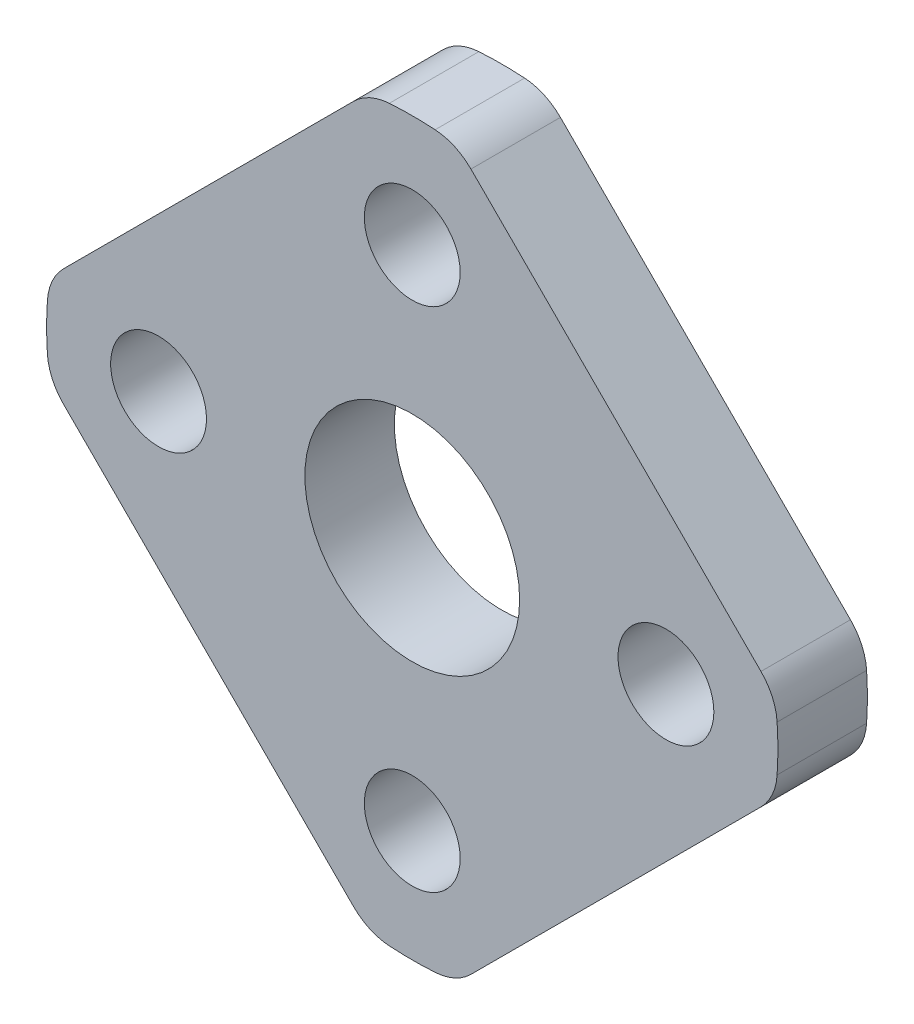
ISO-10303-21;
HEADER;
FILE_DESCRIPTION(('STEP AP214'),'2;1');
FILE_NAME('part.step','',(''),(''),'','','');
FILE_SCHEMA(('AUTOMOTIVE_DESIGN { 1 0 10303 214 1 1 1 1 }'));
ENDSEC;
DATA;
#1=APPLICATION_CONTEXT('core data for automotive mechanical design processes');
#2=APPLICATION_PROTOCOL_DEFINITION('international standard','automotive_design',2000,#1);
#3=PRODUCT_CONTEXT('',#1,'mechanical');
#4=PRODUCT('Part','Part','',(#3));
#5=PRODUCT_RELATED_PRODUCT_CATEGORY('part','',(#4));
#6=PRODUCT_DEFINITION_FORMATION('','',#4);
#7=PRODUCT_DEFINITION_CONTEXT('part definition',#1,'design');
#8=PRODUCT_DEFINITION('design','',#6,#7);
#9=PRODUCT_DEFINITION_SHAPE('','',#8);
#10=(LENGTH_UNIT() NAMED_UNIT(*) SI_UNIT(.MILLI.,.METRE.));
#11=(NAMED_UNIT(*) PLANE_ANGLE_UNIT() SI_UNIT($,.RADIAN.));
#12=(NAMED_UNIT(*) SI_UNIT($,.STERADIAN.) SOLID_ANGLE_UNIT());
#13=UNCERTAINTY_MEASURE_WITH_UNIT(LENGTH_MEASURE(1.E-05),#10,'distance_accuracy_value','');
#14=(GEOMETRIC_REPRESENTATION_CONTEXT(3) GLOBAL_UNCERTAINTY_ASSIGNED_CONTEXT((#13)) GLOBAL_UNIT_ASSIGNED_CONTEXT((#10,
#11,#12)) REPRESENTATION_CONTEXT('',''));
#15=CARTESIAN_POINT('',(0.,0.,0.));
#16=DIRECTION('',(0.,0.,1.));
#17=DIRECTION('',(1.,0.,0.));
#18=AXIS2_PLACEMENT_3D('',#15,#16,#17);
#19=CARTESIAN_POINT('',(-0.688852037974348,10.9784098516032,3.175));
#20=DIRECTION('',(0.,0.,1.));
#21=DIRECTION('',(1.,0.,0.));
#22=AXIS2_PLACEMENT_3D('',#19,#20,#21);
#23=PLANE('',#22);
#24=CARTESIAN_POINT('',(9.00000000000001,0.,3.175));
#25=DIRECTION('',(0.,0.,1.));
#26=DIRECTION('',(1.,0.,0.));
#27=AXIS2_PLACEMENT_3D('',#24,#25,#26);
#28=CIRCLE('',#27,1.7);
#29=CARTESIAN_POINT('',(10.7,0.,3.175));
#30=VERTEX_POINT('',#29);
#31=EDGE_CURVE('E357',#30,#30,#28,.T.);
#32=ORIENTED_EDGE('',*,*,#31,.F.);
#33=EDGE_LOOP('',(#32));
#34=FACE_BOUND('',#33,.T.);
#35=CARTESIAN_POINT('',(-8.99999999999999,0.,3.175));
#36=DIRECTION('',(0.,0.,1.));
#37=DIRECTION('',(1.,0.,0.));
#38=AXIS2_PLACEMENT_3D('',#35,#36,#37);
#39=CIRCLE('',#38,1.7);
#40=CARTESIAN_POINT('',(-7.29999999999999,0.,3.175));
#41=VERTEX_POINT('',#40);
#42=EDGE_CURVE('E369',#41,#41,#39,.T.);
#43=ORIENTED_EDGE('',*,*,#42,.F.);
#44=EDGE_LOOP('',(#43));
#45=FACE_BOUND('',#44,.T.);
#46=CARTESIAN_POINT('',(-0.688852037974348,10.9784098516032,3.175));
#47=DIRECTION('',(0.,0.,1.));
#48=DIRECTION('',(1.,0.,0.));
#49=AXIS2_PLACEMENT_3D('',#46,#47,#48);
#50=CIRCLE('',#49,1.97);
#51=CARTESIAN_POINT('',(-0.812219175684301,12.9445432522994,3.175));
#52=VERTEX_POINT('',#51);
#53=CARTESIAN_POINT('',(-2.08185239691184,12.3714102105407,3.175));
#54=VERTEX_POINT('',#53);
#55=EDGE_CURVE('E219',#52,#54,#50,.T.);
#56=ORIENTED_EDGE('',*,*,#55,.T.);
#57=DIRECTION('',(-0.707106781186547,-0.707106781186547,0.));
#58=VECTOR('',#57,1.);
#59=CARTESIAN_POINT('',(-2.08185239691184,12.3714102105407,3.175));
#60=LINE('',#59,#58);
#61=CARTESIAN_POINT('',(-12.3714102105407,2.08185239691188,3.175));
#62=VERTEX_POINT('',#61);
#63=EDGE_CURVE('E127',#54,#62,#60,.T.);
#64=ORIENTED_EDGE('',*,*,#63,.T.);
#65=CARTESIAN_POINT('',(-10.978409851603,0.688852037974608,3.175));
#66=DIRECTION('',(0.,0.,1.));
#67=DIRECTION('',(1.,0.,0.));
#68=AXIS2_PLACEMENT_3D('',#65,#66,#67);
#69=CIRCLE('',#68,1.96999999999997);
#70=CARTESIAN_POINT('',(-12.9445432522992,0.812219175684563,3.175));
#71=VERTEX_POINT('',#70);
#72=EDGE_CURVE('E258',#62,#71,#69,.T.);
#73=ORIENTED_EDGE('',*,*,#72,.T.);
#74=CARTESIAN_POINT('',(2.09793120375945E-13,1.96030529048957E-13,3.175));
#75=DIRECTION('',(0.,0.,1.));
#76=DIRECTION('',(1.,0.,0.));
#77=AXIS2_PLACEMENT_3D('',#74,#75,#76);
#78=CIRCLE('',#77,12.97);
#79=CARTESIAN_POINT('',(-12.9445432522992,-0.812219175684114,3.175));
#80=VERTEX_POINT('',#79);
#81=EDGE_CURVE('E277',#71,#80,#78,.T.);
#82=ORIENTED_EDGE('',*,*,#81,.T.);
#83=CARTESIAN_POINT('',(-10.978409851603,-0.688852037974166,3.175));
#84=DIRECTION('',(0.,0.,1.));
#85=DIRECTION('',(1.,0.,0.));
#86=AXIS2_PLACEMENT_3D('',#83,#84,#85);
#87=CIRCLE('',#86,1.97);
#88=CARTESIAN_POINT('',(-12.3714102105405,-2.08185239691166,3.175));
#89=VERTEX_POINT('',#88);
#90=EDGE_CURVE('E274',#80,#89,#87,.T.);
#91=ORIENTED_EDGE('',*,*,#90,.T.);
#92=DIRECTION('',(0.707106781186548,-0.707106781186548,0.));
#93=VECTOR('',#92,1.);
#94=CARTESIAN_POINT('',(-12.3714102105405,-2.08185239691167,3.175));
#95=LINE('',#94,#93);
#96=CARTESIAN_POINT('',(-2.08185239691154,-12.3714102105406,3.175));
#97=VERTEX_POINT('',#96);
#98=EDGE_CURVE('E276',#89,#97,#95,.T.);
#99=ORIENTED_EDGE('',*,*,#98,.T.);
#100=CARTESIAN_POINT('',(-0.688852037974057,-10.9784098516031,3.175));
#101=DIRECTION('',(0.,0.,1.));
#102=DIRECTION('',(1.,0.,0.));
#103=AXIS2_PLACEMENT_3D('',#100,#101,#102);
#104=CIRCLE('',#103,1.96999999999999);
#105=CARTESIAN_POINT('',(-0.812219175684017,-12.9445432522993,3.175));
#106=VERTEX_POINT('',#105);
#107=EDGE_CURVE('E279',#97,#106,#104,.T.);
#108=ORIENTED_EDGE('',*,*,#107,.T.);
#109=CARTESIAN_POINT('',(3.52799386926783E-13,1.03080521549059E-13,3.175));
#110=DIRECTION('',(0.,0.,1.));
#111=DIRECTION('',(1.,0.,0.));
#112=AXIS2_PLACEMENT_3D('',#109,#110,#111);
#113=CIRCLE('',#112,12.97);
#114=CARTESIAN_POINT('',(0.812219175684657,-12.9445432522993,3.175));
#115=VERTEX_POINT('',#114);
#116=EDGE_CURVE('E285',#106,#115,#113,.T.);
#117=ORIENTED_EDGE('',*,*,#116,.T.);
#118=CARTESIAN_POINT('',(0.688852037974714,-10.9784098516031,3.175));
#119=DIRECTION('',(0.,0.,1.));
#120=DIRECTION('',(1.,0.,0.));
#121=AXIS2_PLACEMENT_3D('',#118,#119,#120);
#122=CIRCLE('',#121,1.97000000000001);
#123=CARTESIAN_POINT('',(2.08185239691289,-12.3714102105399,3.175));
#124=VERTEX_POINT('',#123);
#125=EDGE_CURVE('E287',#115,#124,#122,.T.);
#126=ORIENTED_EDGE('',*,*,#125,.T.);
#127=DIRECTION('',(0.707106781186548,0.707106781186547,0.));
#128=VECTOR('',#127,1.);
#129=CARTESIAN_POINT('',(2.08185239691289,-12.3714102105399,3.175));
#130=LINE('',#129,#128);
#131=CARTESIAN_POINT('',(12.3714102105413,-2.08185239691153,3.175));
#132=VERTEX_POINT('',#131);
#133=EDGE_CURVE('E289',#124,#132,#130,.T.);
#134=ORIENTED_EDGE('',*,*,#133,.T.);
#135=CARTESIAN_POINT('',(10.9784098516038,-0.688852037974074,3.175));
#136=DIRECTION('',(0.,0.,1.));
#137=DIRECTION('',(1.,0.,0.));
#138=AXIS2_PLACEMENT_3D('',#135,#136,#137);
#139=CIRCLE('',#138,1.96999999999996);
#140=CARTESIAN_POINT('',(12.9445432523,-0.81221917568395,3.175));
#141=VERTEX_POINT('',#140);
#142=EDGE_CURVE('E291',#132,#141,#139,.T.);
#143=ORIENTED_EDGE('',*,*,#142,.T.);
#144=CARTESIAN_POINT('',(5.90902417543838E-13,3.71528485224192E-13,3.175));
#145=DIRECTION('',(0.,0.,1.));
#146=DIRECTION('',(1.,0.,0.));
#147=AXIS2_PLACEMENT_3D('',#144,#145,#146);
#148=CIRCLE('',#147,12.97);
#149=CARTESIAN_POINT('',(12.9445432523,0.8122191756847,3.175));
#150=VERTEX_POINT('',#149);
#151=EDGE_CURVE('E293',#141,#150,#148,.T.);
#152=ORIENTED_EDGE('',*,*,#151,.T.);
#153=CARTESIAN_POINT('',(10.9784098516038,0.688852037973795,3.175));
#154=DIRECTION('',(0.,0.,1.));
#155=DIRECTION('',(1.,0.,0.));
#156=AXIS2_PLACEMENT_3D('',#153,#154,#155);
#157=CIRCLE('',#156,1.97);
#158=CARTESIAN_POINT('',(12.3714102105397,2.08185239691295,3.175));
#159=VERTEX_POINT('',#158);
#160=EDGE_CURVE('E170',#150,#159,#157,.T.);
#161=ORIENTED_EDGE('',*,*,#160,.T.);
#162=DIRECTION('',(-0.707106781186548,0.707106781186548,0.));
#163=VECTOR('',#162,1.);
#164=CARTESIAN_POINT('',(12.3714102105397,2.08185239691295,3.175));
#165=LINE('',#164,#163);
#166=CARTESIAN_POINT('',(2.08185239691191,12.3714102105407,3.175));
#167=VERTEX_POINT('',#166);
#168=EDGE_CURVE('E164',#159,#167,#165,.T.);
#169=ORIENTED_EDGE('',*,*,#168,.T.);
#170=CARTESIAN_POINT('',(0.688852037974424,10.9784098516032,3.175));
#171=DIRECTION('',(0.,0.,1.));
#172=DIRECTION('',(1.,0.,0.));
#173=AXIS2_PLACEMENT_3D('',#170,#171,#172);
#174=CIRCLE('',#173,1.96999999999999);
#175=CARTESIAN_POINT('',(0.812219175684387,12.9445432522994,3.175));
#176=VERTEX_POINT('',#175);
#177=EDGE_CURVE('E168',#167,#176,#174,.T.);
#178=ORIENTED_EDGE('',*,*,#177,.T.);
#179=CARTESIAN_POINT('',(0.,0.,3.175));
#180=DIRECTION('',(0.,0.,1.));
#181=DIRECTION('',(1.,0.,0.));
#182=AXIS2_PLACEMENT_3D('',#179,#180,#181);
#183=CIRCLE('',#182,12.97);
#184=EDGE_CURVE('E60',#176,#52,#183,.T.);
#185=ORIENTED_EDGE('',*,*,#184,.T.);
#186=EDGE_LOOP('',(#56,#64,#73,#82,#91,#99,#108,#117,#126,#134,#143,#152,#161,#169,#178,#185));
#187=FACE_BOUND('',#186,.T.);
#188=CARTESIAN_POINT('',(0.,-9.,3.175));
#189=DIRECTION('',(0.,0.,1.));
#190=DIRECTION('',(1.,0.,0.));
#191=AXIS2_PLACEMENT_3D('',#188,#189,#190);
#192=CIRCLE('',#191,1.7);
#193=CARTESIAN_POINT('',(1.70000000000002,-9.,3.175));
#194=VERTEX_POINT('',#193);
#195=EDGE_CURVE('E192',#194,#194,#192,.T.);
#196=ORIENTED_EDGE('',*,*,#195,.F.);
#197=EDGE_LOOP('',(#196));
#198=FACE_BOUND('',#197,.T.);
#199=CARTESIAN_POINT('',(0.,9.,3.175));
#200=DIRECTION('',(0.,0.,1.));
#201=DIRECTION('',(1.,0.,0.));
#202=AXIS2_PLACEMENT_3D('',#199,#200,#201);
#203=CIRCLE('',#202,1.7);
#204=CARTESIAN_POINT('',(1.70000000000001,9.,3.175));
#205=VERTEX_POINT('',#204);
#206=EDGE_CURVE('E363',#205,#205,#203,.T.);
#207=ORIENTED_EDGE('',*,*,#206,.F.);
#208=EDGE_LOOP('',(#207));
#209=FACE_BOUND('',#208,.T.);
#210=CARTESIAN_POINT('',(2.09793120375945E-13,1.96030529048957E-13,3.175));
#211=DIRECTION('',(0.,0.,1.));
#212=DIRECTION('',(1.,0.,0.));
#213=AXIS2_PLACEMENT_3D('',#210,#211,#212);
#214=CIRCLE('',#213,3.81);
#215=CARTESIAN_POINT('',(3.81000000000021,1.96030529048957E-13,3.175));
#216=VERTEX_POINT('',#215);
#217=EDGE_CURVE('E348',#216,#216,#214,.T.);
#218=ORIENTED_EDGE('',*,*,#217,.F.);
#219=EDGE_LOOP('',(#218));
#220=FACE_BOUND('',#219,.T.);
#221=ADVANCED_FACE('F43',(#34,#45,#187,#198,#209,#220),#23,.T.);
#222=CARTESIAN_POINT('',(-0.688852037974348,10.9784098516032,0.));
#223=DIRECTION('',(0.,0.,1.));
#224=DIRECTION('',(1.,0.,0.));
#225=AXIS2_PLACEMENT_3D('',#222,#223,#224);
#226=PLANE('',#225);
#227=CARTESIAN_POINT('',(-0.688852037974348,10.9784098516032,0.));
#228=DIRECTION('',(0.,0.,1.));
#229=DIRECTION('',(1.,0.,0.));
#230=AXIS2_PLACEMENT_3D('',#227,#228,#229);
#231=CIRCLE('',#230,1.97);
#232=CARTESIAN_POINT('',(-0.812219175684301,12.9445432522994,0.));
#233=VERTEX_POINT('',#232);
#234=CARTESIAN_POINT('',(-2.08185239691184,12.3714102105407,0.));
#235=VERTEX_POINT('',#234);
#236=EDGE_CURVE('E188',#233,#235,#231,.T.);
#237=ORIENTED_EDGE('',*,*,#236,.F.);
#238=CARTESIAN_POINT('',(0.,0.,0.));
#239=DIRECTION('',(0.,0.,1.));
#240=DIRECTION('',(1.,0.,0.));
#241=AXIS2_PLACEMENT_3D('',#238,#239,#240);
#242=CIRCLE('',#241,12.97);
#243=CARTESIAN_POINT('',(0.812219175684387,12.9445432522994,0.));
#244=VERTEX_POINT('',#243);
#245=EDGE_CURVE('E119',#244,#233,#242,.T.);
#246=ORIENTED_EDGE('',*,*,#245,.F.);
#247=CARTESIAN_POINT('',(0.688852037974424,10.9784098516032,0.));
#248=DIRECTION('',(0.,0.,1.));
#249=DIRECTION('',(1.,0.,0.));
#250=AXIS2_PLACEMENT_3D('',#247,#248,#249);
#251=CIRCLE('',#250,1.96999999999999);
#252=CARTESIAN_POINT('',(2.08185239691191,12.3714102105407,0.));
#253=VERTEX_POINT('',#252);
#254=EDGE_CURVE('E113',#253,#244,#251,.T.);
#255=ORIENTED_EDGE('',*,*,#254,.F.);
#256=DIRECTION('',(-0.707106781186548,0.707106781186548,0.));
#257=VECTOR('',#256,1.);
#258=CARTESIAN_POINT('',(12.3714102105397,2.08185239691295,0.));
#259=LINE('',#258,#257);
#260=CARTESIAN_POINT('',(12.3714102105397,2.08185239691295,0.));
#261=VERTEX_POINT('',#260);
#262=EDGE_CURVE('E178',#261,#253,#259,.T.);
#263=ORIENTED_EDGE('',*,*,#262,.F.);
#264=CARTESIAN_POINT('',(10.9784098516038,0.688852037973795,0.));
#265=DIRECTION('',(0.,0.,1.));
#266=DIRECTION('',(1.,0.,0.));
#267=AXIS2_PLACEMENT_3D('',#264,#265,#266);
#268=CIRCLE('',#267,1.97);
#269=CARTESIAN_POINT('',(12.9445432523,0.8122191756847,0.));
#270=VERTEX_POINT('',#269);
#271=EDGE_CURVE('E214',#270,#261,#268,.T.);
#272=ORIENTED_EDGE('',*,*,#271,.F.);
#273=CARTESIAN_POINT('',(5.90902417543838E-13,3.71528485224192E-13,0.));
#274=DIRECTION('',(0.,0.,1.));
#275=DIRECTION('',(1.,0.,0.));
#276=AXIS2_PLACEMENT_3D('',#273,#274,#275);
#277=CIRCLE('',#276,12.97);
#278=CARTESIAN_POINT('',(12.9445432523,-0.81221917568395,0.));
#279=VERTEX_POINT('',#278);
#280=EDGE_CURVE('E212',#279,#270,#277,.T.);
#281=ORIENTED_EDGE('',*,*,#280,.F.);
#282=CARTESIAN_POINT('',(10.9784098516038,-0.688852037974074,0.));
#283=DIRECTION('',(0.,0.,1.));
#284=DIRECTION('',(1.,0.,0.));
#285=AXIS2_PLACEMENT_3D('',#282,#283,#284);
#286=CIRCLE('',#285,1.96999999999996);
#287=CARTESIAN_POINT('',(12.3714102105413,-2.08185239691153,0.));
#288=VERTEX_POINT('',#287);
#289=EDGE_CURVE('E210',#288,#279,#286,.T.);
#290=ORIENTED_EDGE('',*,*,#289,.F.);
#291=DIRECTION('',(0.707106781186548,0.707106781186547,0.));
#292=VECTOR('',#291,1.);
#293=CARTESIAN_POINT('',(2.08185239691289,-12.3714102105399,0.));
#294=LINE('',#293,#292);
#295=CARTESIAN_POINT('',(2.08185239691289,-12.3714102105399,0.));
#296=VERTEX_POINT('',#295);
#297=EDGE_CURVE('E208',#296,#288,#294,.T.);
#298=ORIENTED_EDGE('',*,*,#297,.F.);
#299=CARTESIAN_POINT('',(0.688852037974714,-10.9784098516031,0.));
#300=DIRECTION('',(0.,0.,1.));
#301=DIRECTION('',(1.,0.,0.));
#302=AXIS2_PLACEMENT_3D('',#299,#300,#301);
#303=CIRCLE('',#302,1.97000000000001);
#304=CARTESIAN_POINT('',(0.812219175684657,-12.9445432522993,0.));
#305=VERTEX_POINT('',#304);
#306=EDGE_CURVE('E206',#305,#296,#303,.T.);
#307=ORIENTED_EDGE('',*,*,#306,.F.);
#308=CARTESIAN_POINT('',(3.52799386926783E-13,1.03080521549059E-13,0.));
#309=DIRECTION('',(0.,0.,1.));
#310=DIRECTION('',(1.,0.,0.));
#311=AXIS2_PLACEMENT_3D('',#308,#309,#310);
#312=CIRCLE('',#311,12.97);
#313=CARTESIAN_POINT('',(-0.812219175684017,-12.9445432522993,0.));
#314=VERTEX_POINT('',#313);
#315=EDGE_CURVE('E204',#314,#305,#312,.T.);
#316=ORIENTED_EDGE('',*,*,#315,.F.);
#317=CARTESIAN_POINT('',(-0.688852037974057,-10.9784098516031,0.));
#318=DIRECTION('',(0.,0.,1.));
#319=DIRECTION('',(1.,0.,0.));
#320=AXIS2_PLACEMENT_3D('',#317,#318,#319);
#321=CIRCLE('',#320,1.96999999999999);
#322=CARTESIAN_POINT('',(-2.08185239691154,-12.3714102105406,0.));
#323=VERTEX_POINT('',#322);
#324=EDGE_CURVE('E202',#323,#314,#321,.T.);
#325=ORIENTED_EDGE('',*,*,#324,.F.);
#326=DIRECTION('',(0.707106781186548,-0.707106781186548,0.));
#327=VECTOR('',#326,1.);
#328=CARTESIAN_POINT('',(-12.3714102105405,-2.08185239691167,0.));
#329=LINE('',#328,#327);
#330=CARTESIAN_POINT('',(-12.3714102105405,-2.08185239691166,0.));
#331=VERTEX_POINT('',#330);
#332=EDGE_CURVE('E200',#331,#323,#329,.T.);
#333=ORIENTED_EDGE('',*,*,#332,.F.);
#334=CARTESIAN_POINT('',(-10.978409851603,-0.688852037974166,0.));
#335=DIRECTION('',(0.,0.,1.));
#336=DIRECTION('',(1.,0.,0.));
#337=AXIS2_PLACEMENT_3D('',#334,#335,#336);
#338=CIRCLE('',#337,1.97);
#339=CARTESIAN_POINT('',(-12.9445432522992,-0.812219175684114,0.));
#340=VERTEX_POINT('',#339);
#341=EDGE_CURVE('E198',#340,#331,#338,.T.);
#342=ORIENTED_EDGE('',*,*,#341,.F.);
#343=CARTESIAN_POINT('',(2.09793120375945E-13,1.96030529048957E-13,0.));
#344=DIRECTION('',(0.,0.,1.));
#345=DIRECTION('',(1.,0.,0.));
#346=AXIS2_PLACEMENT_3D('',#343,#344,#345);
#347=CIRCLE('',#346,12.97);
#348=CARTESIAN_POINT('',(-12.9445432522992,0.812219175684563,0.));
#349=VERTEX_POINT('',#348);
#350=EDGE_CURVE('E196',#349,#340,#347,.T.);
#351=ORIENTED_EDGE('',*,*,#350,.F.);
#352=CARTESIAN_POINT('',(-10.978409851603,0.688852037974608,0.));
#353=DIRECTION('',(0.,0.,1.));
#354=DIRECTION('',(1.,0.,0.));
#355=AXIS2_PLACEMENT_3D('',#352,#353,#354);
#356=CIRCLE('',#355,1.96999999999997);
#357=CARTESIAN_POINT('',(-12.3714102105407,2.08185239691188,0.));
#358=VERTEX_POINT('',#357);
#359=EDGE_CURVE('E194',#358,#349,#356,.T.);
#360=ORIENTED_EDGE('',*,*,#359,.F.);
#361=DIRECTION('',(-0.707106781186547,-0.707106781186547,0.));
#362=VECTOR('',#361,1.);
#363=CARTESIAN_POINT('',(-2.08185239691184,12.3714102105407,0.));
#364=LINE('',#363,#362);
#365=EDGE_CURVE('E191',#235,#358,#364,.T.);
#366=ORIENTED_EDGE('',*,*,#365,.F.);
#367=EDGE_LOOP('',(#237,#246,#255,#263,#272,#281,#290,#298,#307,#316,#325,#333,#342,#351,#360,#366));
#368=FACE_BOUND('',#367,.T.);
#369=CARTESIAN_POINT('',(0.,-9.,0.));
#370=DIRECTION('',(0.,0.,1.));
#371=DIRECTION('',(1.,0.,0.));
#372=AXIS2_PLACEMENT_3D('',#369,#370,#371);
#373=CIRCLE('',#372,1.7);
#374=CARTESIAN_POINT('',(1.70000000000002,-9.,0.));
#375=VERTEX_POINT('',#374);
#376=EDGE_CURVE('E372',#375,#375,#373,.T.);
#377=ORIENTED_EDGE('',*,*,#376,.T.);
#378=EDGE_LOOP('',(#377));
#379=FACE_BOUND('',#378,.T.);
#380=CARTESIAN_POINT('',(-8.99999999999999,0.,0.));
#381=DIRECTION('',(0.,0.,1.));
#382=DIRECTION('',(1.,0.,0.));
#383=AXIS2_PLACEMENT_3D('',#380,#381,#382);
#384=CIRCLE('',#383,1.7);
#385=CARTESIAN_POINT('',(-7.29999999999999,0.,0.));
#386=VERTEX_POINT('',#385);
#387=EDGE_CURVE('E366',#386,#386,#384,.T.);
#388=ORIENTED_EDGE('',*,*,#387,.T.);
#389=EDGE_LOOP('',(#388));
#390=FACE_BOUND('',#389,.T.);
#391=CARTESIAN_POINT('',(0.,9.,0.));
#392=DIRECTION('',(0.,0.,1.));
#393=DIRECTION('',(1.,0.,0.));
#394=AXIS2_PLACEMENT_3D('',#391,#392,#393);
#395=CIRCLE('',#394,1.7);
#396=CARTESIAN_POINT('',(1.70000000000001,9.,0.));
#397=VERTEX_POINT('',#396);
#398=EDGE_CURVE('E360',#397,#397,#395,.T.);
#399=ORIENTED_EDGE('',*,*,#398,.T.);
#400=EDGE_LOOP('',(#399));
#401=FACE_BOUND('',#400,.T.);
#402=CARTESIAN_POINT('',(9.00000000000001,0.,0.));
#403=DIRECTION('',(0.,0.,1.));
#404=DIRECTION('',(1.,0.,0.));
#405=AXIS2_PLACEMENT_3D('',#402,#403,#404);
#406=CIRCLE('',#405,1.7);
#407=CARTESIAN_POINT('',(10.7,0.,0.));
#408=VERTEX_POINT('',#407);
#409=EDGE_CURVE('E354',#408,#408,#406,.T.);
#410=ORIENTED_EDGE('',*,*,#409,.T.);
#411=EDGE_LOOP('',(#410));
#412=FACE_BOUND('',#411,.T.);
#413=CARTESIAN_POINT('',(2.09793120375945E-13,1.96030529048957E-13,0.));
#414=DIRECTION('',(0.,0.,1.));
#415=DIRECTION('',(1.,0.,0.));
#416=AXIS2_PLACEMENT_3D('',#413,#414,#415);
#417=CIRCLE('',#416,3.81);
#418=CARTESIAN_POINT('',(3.81000000000021,1.96030529048957E-13,0.));
#419=VERTEX_POINT('',#418);
#420=EDGE_CURVE('E351',#419,#419,#417,.T.);
#421=ORIENTED_EDGE('',*,*,#420,.T.);
#422=EDGE_LOOP('',(#421));
#423=FACE_BOUND('',#422,.T.);
#424=ADVANCED_FACE('F262',(#368,#379,#390,#401,#412,#423),#226,.F.);
#425=CARTESIAN_POINT('',(-0.688852037974348,10.9784098516032,3.175));
#426=DIRECTION('',(0.,0.,-1.));
#427=DIRECTION('',(-1.,0.,0.));
#428=AXIS2_PLACEMENT_3D('',#425,#426,#427);
#429=CYLINDRICAL_SURFACE('',#428,1.97);
#430=ORIENTED_EDGE('',*,*,#236,.T.);
#431=DIRECTION('',(0.,0.,-1.));
#432=VECTOR('',#431,1.);
#433=CARTESIAN_POINT('',(-2.08185239691184,12.3714102105407,3.175));
#434=LINE('',#433,#432);
#435=EDGE_CURVE('E11',#54,#235,#434,.T.);
#436=ORIENTED_EDGE('',*,*,#435,.F.);
#437=ORIENTED_EDGE('',*,*,#55,.F.);
#438=DIRECTION('',(0.,0.,-1.));
#439=VECTOR('',#438,1.);
#440=CARTESIAN_POINT('',(-0.812219175684301,12.9445432522994,3.175));
#441=LINE('',#440,#439);
#442=EDGE_CURVE('E184',#52,#233,#441,.T.);
#443=ORIENTED_EDGE('',*,*,#442,.T.);
#444=EDGE_LOOP('',(#430,#436,#437,#443));
#445=FACE_BOUND('',#444,.T.);
#446=ADVANCED_FACE('F45',(#445),#429,.T.);
#447=CARTESIAN_POINT('',(-2.08185239691184,12.3714102105407,3.175));
#448=DIRECTION('',(0.707106781186548,-0.707106781186548,0.));
#449=DIRECTION('',(0.707106781186548,0.707106781186548,0.));
#450=AXIS2_PLACEMENT_3D('',#447,#448,#449);
#451=PLANE('',#450);
#452=ORIENTED_EDGE('',*,*,#365,.T.);
#453=DIRECTION('',(0.,0.,-1.));
#454=VECTOR('',#453,1.);
#455=CARTESIAN_POINT('',(-12.3714102105407,2.08185239691188,3.175));
#456=LINE('',#455,#454);
#457=EDGE_CURVE('E52',#62,#358,#456,.T.);
#458=ORIENTED_EDGE('',*,*,#457,.F.);
#459=ORIENTED_EDGE('',*,*,#63,.F.);
#460=ORIENTED_EDGE('',*,*,#435,.T.);
#461=EDGE_LOOP('',(#452,#458,#459,#460));
#462=FACE_BOUND('',#461,.T.);
#463=ADVANCED_FACE('F536',(#462),#451,.F.);
#464=CARTESIAN_POINT('',(-10.978409851603,0.688852037974608,3.175));
#465=DIRECTION('',(0.,0.,-1.));
#466=DIRECTION('',(-1.,0.,0.));
#467=AXIS2_PLACEMENT_3D('',#464,#465,#466);
#468=CYLINDRICAL_SURFACE('',#467,1.96999999999997);
#469=ORIENTED_EDGE('',*,*,#359,.T.);
#470=DIRECTION('',(0.,0.,-1.));
#471=VECTOR('',#470,1.);
#472=CARTESIAN_POINT('',(-12.9445432522992,0.812219175684563,3.175));
#473=LINE('',#472,#471);
#474=EDGE_CURVE('E250',#71,#349,#473,.T.);
#475=ORIENTED_EDGE('',*,*,#474,.F.);
#476=ORIENTED_EDGE('',*,*,#72,.F.);
#477=ORIENTED_EDGE('',*,*,#457,.T.);
#478=EDGE_LOOP('',(#469,#475,#476,#477));
#479=FACE_BOUND('',#478,.T.);
#480=ADVANCED_FACE('F256',(#479),#468,.T.);
#481=CARTESIAN_POINT('',(2.09793120375945E-13,1.96030529048957E-13,3.175));
#482=DIRECTION('',(0.,0.,-1.));
#483=DIRECTION('',(-1.,0.,0.));
#484=AXIS2_PLACEMENT_3D('',#481,#482,#483);
#485=CYLINDRICAL_SURFACE('',#484,12.97);
#486=ORIENTED_EDGE('',*,*,#350,.T.);
#487=DIRECTION('',(0.,0.,-1.));
#488=VECTOR('',#487,1.);
#489=CARTESIAN_POINT('',(-12.9445432522992,-0.812219175684114,3.175));
#490=LINE('',#489,#488);
#491=EDGE_CURVE('E247',#80,#340,#490,.T.);
#492=ORIENTED_EDGE('',*,*,#491,.F.);
#493=ORIENTED_EDGE('',*,*,#81,.F.);
#494=ORIENTED_EDGE('',*,*,#474,.T.);
#495=EDGE_LOOP('',(#486,#492,#493,#494));
#496=FACE_BOUND('',#495,.T.);
#497=ADVANCED_FACE('F268',(#496),#485,.T.);
#498=CARTESIAN_POINT('',(-10.978409851603,-0.688852037974166,3.175));
#499=DIRECTION('',(0.,0.,-1.));
#500=DIRECTION('',(-1.,0.,0.));
#501=AXIS2_PLACEMENT_3D('',#498,#499,#500);
#502=CYLINDRICAL_SURFACE('',#501,1.97);
#503=ORIENTED_EDGE('',*,*,#341,.T.);
#504=DIRECTION('',(0.,0.,-1.));
#505=VECTOR('',#504,1.);
#506=CARTESIAN_POINT('',(-12.3714102105405,-2.08185239691166,3.175));
#507=LINE('',#506,#505);
#508=EDGE_CURVE('E244',#89,#331,#507,.T.);
#509=ORIENTED_EDGE('',*,*,#508,.F.);
#510=ORIENTED_EDGE('',*,*,#90,.F.);
#511=ORIENTED_EDGE('',*,*,#491,.T.);
#512=EDGE_LOOP('',(#503,#509,#510,#511));
#513=FACE_BOUND('',#512,.T.);
#514=ADVANCED_FACE('F272',(#513),#502,.T.);
#515=CARTESIAN_POINT('',(-12.3714102105405,-2.08185239691167,3.175));
#516=DIRECTION('',(0.707106781186548,0.707106781186548,0.));
#517=DIRECTION('',(-0.707106781186548,0.707106781186548,0.));
#518=AXIS2_PLACEMENT_3D('',#515,#516,#517);
#519=PLANE('',#518);
#520=ORIENTED_EDGE('',*,*,#332,.T.);
#521=DIRECTION('',(0.,0.,-1.));
#522=VECTOR('',#521,1.);
#523=CARTESIAN_POINT('',(-2.08185239691154,-12.3714102105406,3.175));
#524=LINE('',#523,#522);
#525=EDGE_CURVE('E241',#97,#323,#524,.T.);
#526=ORIENTED_EDGE('',*,*,#525,.F.);
#527=ORIENTED_EDGE('',*,*,#98,.F.);
#528=ORIENTED_EDGE('',*,*,#508,.T.);
#529=EDGE_LOOP('',(#520,#526,#527,#528));
#530=FACE_BOUND('',#529,.T.);
#531=ADVANCED_FACE('F501',(#530),#519,.F.);
#532=CARTESIAN_POINT('',(-0.688852037974057,-10.9784098516031,3.175));
#533=DIRECTION('',(0.,0.,-1.));
#534=DIRECTION('',(-1.,0.,0.));
#535=AXIS2_PLACEMENT_3D('',#532,#533,#534);
#536=CYLINDRICAL_SURFACE('',#535,1.96999999999999);
#537=ORIENTED_EDGE('',*,*,#324,.T.);
#538=DIRECTION('',(0.,0.,-1.));
#539=VECTOR('',#538,1.);
#540=CARTESIAN_POINT('',(-0.812219175684017,-12.9445432522993,3.175));
#541=LINE('',#540,#539);
#542=EDGE_CURVE('E238',#106,#314,#541,.T.);
#543=ORIENTED_EDGE('',*,*,#542,.F.);
#544=ORIENTED_EDGE('',*,*,#107,.F.);
#545=ORIENTED_EDGE('',*,*,#525,.T.);
#546=EDGE_LOOP('',(#537,#543,#544,#545));
#547=FACE_BOUND('',#546,.T.);
#548=ADVANCED_FACE('F491',(#547),#536,.T.);
#549=CARTESIAN_POINT('',(3.52799386926783E-13,1.03080521549059E-13,3.175));
#550=DIRECTION('',(0.,0.,-1.));
#551=DIRECTION('',(-1.,0.,0.));
#552=AXIS2_PLACEMENT_3D('',#549,#550,#551);
#553=CYLINDRICAL_SURFACE('',#552,12.97);
#554=ORIENTED_EDGE('',*,*,#315,.T.);
#555=DIRECTION('',(0.,0.,-1.));
#556=VECTOR('',#555,1.);
#557=CARTESIAN_POINT('',(0.812219175684657,-12.9445432522993,3.175));
#558=LINE('',#557,#556);
#559=EDGE_CURVE('E235',#115,#305,#558,.T.);
#560=ORIENTED_EDGE('',*,*,#559,.F.);
#561=ORIENTED_EDGE('',*,*,#116,.F.);
#562=ORIENTED_EDGE('',*,*,#542,.T.);
#563=EDGE_LOOP('',(#554,#560,#561,#562));
#564=FACE_BOUND('',#563,.T.);
#565=ADVANCED_FACE('F481',(#564),#553,.T.);
#566=CARTESIAN_POINT('',(0.688852037974714,-10.9784098516031,3.175));
#567=DIRECTION('',(0.,0.,-1.));
#568=DIRECTION('',(-1.,0.,0.));
#569=AXIS2_PLACEMENT_3D('',#566,#567,#568);
#570=CYLINDRICAL_SURFACE('',#569,1.97000000000001);
#571=ORIENTED_EDGE('',*,*,#306,.T.);
#572=DIRECTION('',(0.,0.,-1.));
#573=VECTOR('',#572,1.);
#574=CARTESIAN_POINT('',(2.08185239691289,-12.3714102105399,3.175));
#575=LINE('',#574,#573);
#576=EDGE_CURVE('E232',#124,#296,#575,.T.);
#577=ORIENTED_EDGE('',*,*,#576,.F.);
#578=ORIENTED_EDGE('',*,*,#125,.F.);
#579=ORIENTED_EDGE('',*,*,#559,.T.);
#580=EDGE_LOOP('',(#571,#577,#578,#579));
#581=FACE_BOUND('',#580,.T.);
#582=ADVANCED_FACE('F471',(#581),#570,.T.);
#583=CARTESIAN_POINT('',(2.08185239691289,-12.3714102105399,3.175));
#584=DIRECTION('',(-0.707106781186547,0.707106781186548,0.));
#585=DIRECTION('',(-0.707106781186548,-0.707106781186547,0.));
#586=AXIS2_PLACEMENT_3D('',#583,#584,#585);
#587=PLANE('',#586);
#588=ORIENTED_EDGE('',*,*,#297,.T.);
#589=DIRECTION('',(0.,0.,-1.));
#590=VECTOR('',#589,1.);
#591=CARTESIAN_POINT('',(12.3714102105413,-2.08185239691153,3.175));
#592=LINE('',#591,#590);
#593=EDGE_CURVE('E229',#132,#288,#592,.T.);
#594=ORIENTED_EDGE('',*,*,#593,.F.);
#595=ORIENTED_EDGE('',*,*,#133,.F.);
#596=ORIENTED_EDGE('',*,*,#576,.T.);
#597=EDGE_LOOP('',(#588,#594,#595,#596));
#598=FACE_BOUND('',#597,.T.);
#599=ADVANCED_FACE('F461',(#598),#587,.F.);
#600=CARTESIAN_POINT('',(10.9784098516038,-0.688852037974074,3.175));
#601=DIRECTION('',(0.,0.,-1.));
#602=DIRECTION('',(-1.,0.,0.));
#603=AXIS2_PLACEMENT_3D('',#600,#601,#602);
#604=CYLINDRICAL_SURFACE('',#603,1.96999999999996);
#605=ORIENTED_EDGE('',*,*,#289,.T.);
#606=DIRECTION('',(0.,0.,-1.));
#607=VECTOR('',#606,1.);
#608=CARTESIAN_POINT('',(12.9445432523,-0.81221917568395,3.175));
#609=LINE('',#608,#607);
#610=EDGE_CURVE('E226',#141,#279,#609,.T.);
#611=ORIENTED_EDGE('',*,*,#610,.F.);
#612=ORIENTED_EDGE('',*,*,#142,.F.);
#613=ORIENTED_EDGE('',*,*,#593,.T.);
#614=EDGE_LOOP('',(#605,#611,#612,#613));
#615=FACE_BOUND('',#614,.T.);
#616=ADVANCED_FACE('F452',(#615),#604,.T.);
#617=CARTESIAN_POINT('',(5.90902417543838E-13,3.71528485224192E-13,3.175));
#618=DIRECTION('',(0.,0.,-1.));
#619=DIRECTION('',(-1.,0.,0.));
#620=AXIS2_PLACEMENT_3D('',#617,#618,#619);
#621=CYLINDRICAL_SURFACE('',#620,12.97);
#622=ORIENTED_EDGE('',*,*,#280,.T.);
#623=DIRECTION('',(0.,0.,-1.));
#624=VECTOR('',#623,1.);
#625=CARTESIAN_POINT('',(12.9445432523,0.8122191756847,3.175));
#626=LINE('',#625,#624);
#627=EDGE_CURVE('E223',#150,#270,#626,.T.);
#628=ORIENTED_EDGE('',*,*,#627,.F.);
#629=ORIENTED_EDGE('',*,*,#151,.F.);
#630=ORIENTED_EDGE('',*,*,#610,.T.);
#631=EDGE_LOOP('',(#622,#628,#629,#630));
#632=FACE_BOUND('',#631,.T.);
#633=ADVANCED_FACE('F299',(#632),#621,.T.);
#634=CARTESIAN_POINT('',(10.9784098516038,0.688852037973795,3.175));
#635=DIRECTION('',(0.,0.,-1.));
#636=DIRECTION('',(-1.,0.,0.));
#637=AXIS2_PLACEMENT_3D('',#634,#635,#636);
#638=CYLINDRICAL_SURFACE('',#637,1.97);
#639=ORIENTED_EDGE('',*,*,#271,.T.);
#640=DIRECTION('',(0.,0.,-1.));
#641=VECTOR('',#640,1.);
#642=CARTESIAN_POINT('',(12.3714102105397,2.08185239691295,3.175));
#643=LINE('',#642,#641);
#644=EDGE_CURVE('E179',#159,#261,#643,.T.);
#645=ORIENTED_EDGE('',*,*,#644,.F.);
#646=ORIENTED_EDGE('',*,*,#160,.F.);
#647=ORIENTED_EDGE('',*,*,#627,.T.);
#648=EDGE_LOOP('',(#639,#645,#646,#647));
#649=FACE_BOUND('',#648,.T.);
#650=ADVANCED_FACE('F303',(#649),#638,.T.);
#651=CARTESIAN_POINT('',(12.3714102105397,2.08185239691295,3.175));
#652=DIRECTION('',(-0.707106781186548,-0.707106781186548,0.));
#653=DIRECTION('',(0.707106781186548,-0.707106781186548,0.));
#654=AXIS2_PLACEMENT_3D('',#651,#652,#653);
#655=PLANE('',#654);
#656=ORIENTED_EDGE('',*,*,#262,.T.);
#657=DIRECTION('',(0.,0.,-1.));
#658=VECTOR('',#657,1.);
#659=CARTESIAN_POINT('',(2.08185239691191,12.3714102105407,3.175));
#660=LINE('',#659,#658);
#661=EDGE_CURVE('E175',#167,#253,#660,.T.);
#662=ORIENTED_EDGE('',*,*,#661,.F.);
#663=ORIENTED_EDGE('',*,*,#168,.F.);
#664=ORIENTED_EDGE('',*,*,#644,.T.);
#665=EDGE_LOOP('',(#656,#662,#663,#664));
#666=FACE_BOUND('',#665,.T.);
#667=ADVANCED_FACE('F176',(#666),#655,.F.);
#668=CARTESIAN_POINT('',(0.688852037974424,10.9784098516032,3.175));
#669=DIRECTION('',(0.,0.,-1.));
#670=DIRECTION('',(-1.,0.,0.));
#671=AXIS2_PLACEMENT_3D('',#668,#669,#670);
#672=CYLINDRICAL_SURFACE('',#671,1.96999999999999);
#673=ORIENTED_EDGE('',*,*,#254,.T.);
#674=DIRECTION('',(0.,0.,-1.));
#675=VECTOR('',#674,1.);
#676=CARTESIAN_POINT('',(0.812219175684387,12.9445432522994,3.175));
#677=LINE('',#676,#675);
#678=EDGE_CURVE('E180',#176,#244,#677,.T.);
#679=ORIENTED_EDGE('',*,*,#678,.F.);
#680=ORIENTED_EDGE('',*,*,#177,.F.);
#681=ORIENTED_EDGE('',*,*,#661,.T.);
#682=EDGE_LOOP('',(#673,#679,#680,#681));
#683=FACE_BOUND('',#682,.T.);
#684=ADVANCED_FACE('F182',(#683),#672,.T.);
#685=CARTESIAN_POINT('',(0.,0.,3.175));
#686=DIRECTION('',(0.,0.,-1.));
#687=DIRECTION('',(-1.,0.,0.));
#688=AXIS2_PLACEMENT_3D('',#685,#686,#687);
#689=CYLINDRICAL_SURFACE('',#688,12.97);
#690=ORIENTED_EDGE('',*,*,#245,.T.);
#691=ORIENTED_EDGE('',*,*,#442,.F.);
#692=ORIENTED_EDGE('',*,*,#184,.F.);
#693=ORIENTED_EDGE('',*,*,#678,.T.);
#694=EDGE_LOOP('',(#690,#691,#692,#693));
#695=FACE_BOUND('',#694,.T.);
#696=ADVANCED_FACE('F307',(#695),#689,.T.);
#697=CARTESIAN_POINT('',(0.,-9.,3.175));
#698=DIRECTION('',(0.,0.,-1.));
#699=DIRECTION('',(-1.,0.,0.));
#700=AXIS2_PLACEMENT_3D('',#697,#698,#699);
#701=CYLINDRICAL_SURFACE('',#700,1.7);
#702=ORIENTED_EDGE('',*,*,#195,.T.);
#703=EDGE_LOOP('',(#702));
#704=FACE_BOUND('',#703,.T.);
#705=ORIENTED_EDGE('',*,*,#376,.F.);
#706=EDGE_LOOP('',(#705));
#707=FACE_BOUND('',#706,.T.);
#708=ADVANCED_FACE('F309',(#704,#707),#701,.F.);
#709=CARTESIAN_POINT('',(-8.99999999999999,0.,3.175));
#710=DIRECTION('',(0.,0.,-1.));
#711=DIRECTION('',(-1.,0.,0.));
#712=AXIS2_PLACEMENT_3D('',#709,#710,#711);
#713=CYLINDRICAL_SURFACE('',#712,1.7);
#714=ORIENTED_EDGE('',*,*,#42,.T.);
#715=EDGE_LOOP('',(#714));
#716=FACE_BOUND('',#715,.T.);
#717=ORIENTED_EDGE('',*,*,#387,.F.);
#718=EDGE_LOOP('',(#717));
#719=FACE_BOUND('',#718,.T.);
#720=ADVANCED_FACE('F315',(#716,#719),#713,.F.);
#721=CARTESIAN_POINT('',(0.,9.,3.175));
#722=DIRECTION('',(0.,0.,-1.));
#723=DIRECTION('',(-1.,0.,0.));
#724=AXIS2_PLACEMENT_3D('',#721,#722,#723);
#725=CYLINDRICAL_SURFACE('',#724,1.7);
#726=ORIENTED_EDGE('',*,*,#206,.T.);
#727=EDGE_LOOP('',(#726));
#728=FACE_BOUND('',#727,.T.);
#729=ORIENTED_EDGE('',*,*,#398,.F.);
#730=EDGE_LOOP('',(#729));
#731=FACE_BOUND('',#730,.T.);
#732=ADVANCED_FACE('F331',(#728,#731),#725,.F.);
#733=CARTESIAN_POINT('',(9.00000000000001,0.,3.175));
#734=DIRECTION('',(0.,0.,-1.));
#735=DIRECTION('',(-1.,0.,0.));
#736=AXIS2_PLACEMENT_3D('',#733,#734,#735);
#737=CYLINDRICAL_SURFACE('',#736,1.7);
#738=ORIENTED_EDGE('',*,*,#31,.T.);
#739=EDGE_LOOP('',(#738));
#740=FACE_BOUND('',#739,.T.);
#741=ORIENTED_EDGE('',*,*,#409,.F.);
#742=EDGE_LOOP('',(#741));
#743=FACE_BOUND('',#742,.T.);
#744=ADVANCED_FACE('F335',(#740,#743),#737,.F.);
#745=CARTESIAN_POINT('',(2.09793120375945E-13,1.96030529048957E-13,3.175));
#746=DIRECTION('',(0.,0.,-1.));
#747=DIRECTION('',(-1.,0.,0.));
#748=AXIS2_PLACEMENT_3D('',#745,#746,#747);
#749=CYLINDRICAL_SURFACE('',#748,3.81);
#750=ORIENTED_EDGE('',*,*,#217,.T.);
#751=EDGE_LOOP('',(#750));
#752=FACE_BOUND('',#751,.T.);
#753=ORIENTED_EDGE('',*,*,#420,.F.);
#754=EDGE_LOOP('',(#753));
#755=FACE_BOUND('',#754,.T.);
#756=ADVANCED_FACE('F339',(#752,#755),#749,.F.);
#757=CLOSED_SHELL('',(#221,#424,#446,#463,#480,#497,#514,#531,#548,#565,#582,#599,#616,#633,
#650,#667,#684,#696,#708,#720,#732,#744,#756));
#758=MANIFOLD_SOLID_BREP('B2',#757);
#759=ADVANCED_BREP_SHAPE_REPRESENTATION('',(#18,#758),#14);
#760=SHAPE_DEFINITION_REPRESENTATION(#9,#759);
ENDSEC;
END-ISO-10303-21;
